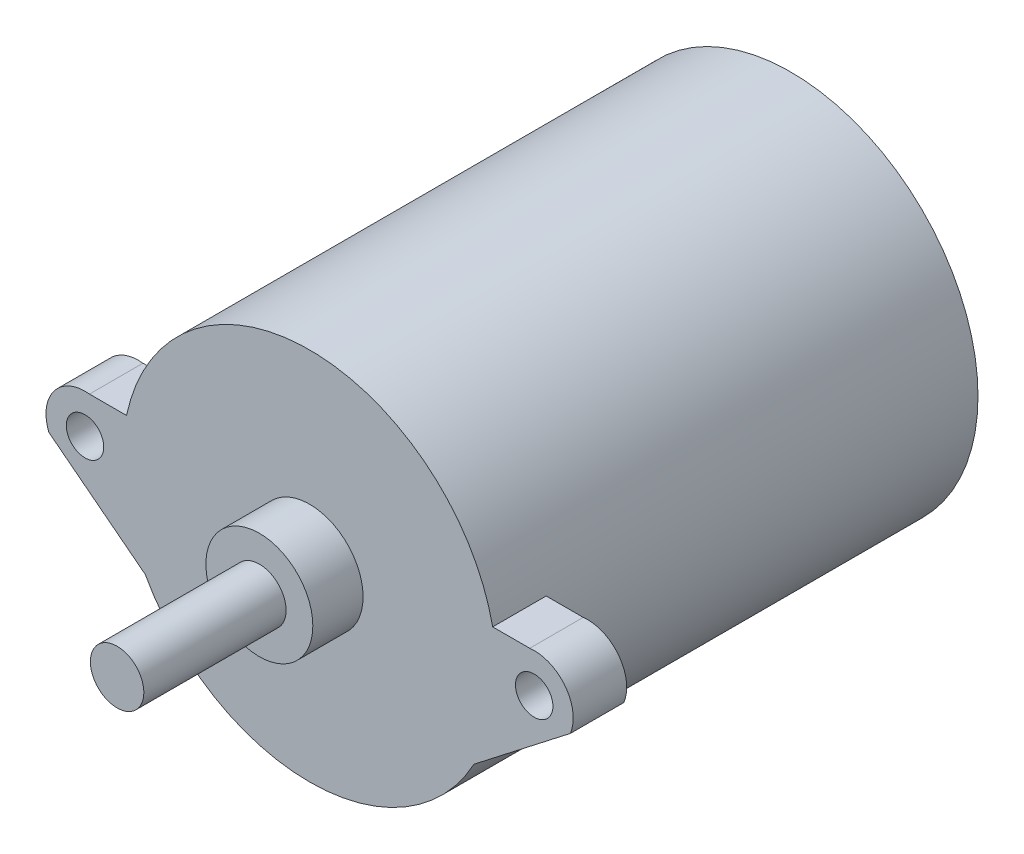
ISO-10303-21;
HEADER;
FILE_DESCRIPTION(('STEP AP214'),'2;1');
FILE_NAME('part.step','',(''),(''),'','','');
FILE_SCHEMA(('AUTOMOTIVE_DESIGN { 1 0 10303 214 1 1 1 1 }'));
ENDSEC;
DATA;
#1=APPLICATION_CONTEXT('core data for automotive mechanical design processes');
#2=APPLICATION_PROTOCOL_DEFINITION('international standard','automotive_design',2000,#1);
#3=PRODUCT_CONTEXT('',#1,'mechanical');
#4=PRODUCT('Part','Part','',(#3));
#5=PRODUCT_RELATED_PRODUCT_CATEGORY('part','',(#4));
#6=PRODUCT_DEFINITION_FORMATION('','',#4);
#7=PRODUCT_DEFINITION_CONTEXT('part definition',#1,'design');
#8=PRODUCT_DEFINITION('design','',#6,#7);
#9=PRODUCT_DEFINITION_SHAPE('','',#8);
#10=(LENGTH_UNIT() NAMED_UNIT(*) SI_UNIT(.MILLI.,.METRE.));
#11=(NAMED_UNIT(*) PLANE_ANGLE_UNIT() SI_UNIT($,.RADIAN.));
#12=(NAMED_UNIT(*) SI_UNIT($,.STERADIAN.) SOLID_ANGLE_UNIT());
#13=UNCERTAINTY_MEASURE_WITH_UNIT(LENGTH_MEASURE(1.E-05),#10,'distance_accuracy_value','');
#14=(GEOMETRIC_REPRESENTATION_CONTEXT(3) GLOBAL_UNCERTAINTY_ASSIGNED_CONTEXT((#13)) GLOBAL_UNIT_ASSIGNED_CONTEXT((#10,
#11,#12)) REPRESENTATION_CONTEXT('',''));
#15=CARTESIAN_POINT('',(0.,0.,0.));
#16=DIRECTION('',(0.,0.,1.));
#17=DIRECTION('',(1.,0.,0.));
#18=AXIS2_PLACEMENT_3D('',#15,#16,#17);
#19=CARTESIAN_POINT('',(0.,0.,-11.98));
#20=DIRECTION('',(0.,0.,1.));
#21=DIRECTION('',(1.,0.,0.));
#22=AXIS2_PLACEMENT_3D('',#19,#20,#21);
#23=CYLINDRICAL_SURFACE('',#22,17.5);
#24=DIRECTION('',(0.,0.,1.));
#25=VECTOR('',#24,1.);
#26=CARTESIAN_POINT('',(-15.3665085315704,-8.37379337870087,28.02));
#27=LINE('',#26,#25);
#28=CARTESIAN_POINT('',(-15.3665085315704,-8.37379337870087,28.02));
#29=VERTEX_POINT('',#28);
#30=CARTESIAN_POINT('',(-15.3665085315704,-8.37379337870086,33.02));
#31=VERTEX_POINT('',#30);
#32=EDGE_CURVE('E123',#29,#31,#27,.T.);
#33=ORIENTED_EDGE('',*,*,#32,.F.);
#34=CARTESIAN_POINT('',(0.,0.,28.02));
#35=DIRECTION('',(0.,0.,1.));
#36=DIRECTION('',(1.,0.,0.));
#37=AXIS2_PLACEMENT_3D('',#34,#35,#36);
#38=CIRCLE('',#37,17.5);
#39=CARTESIAN_POINT('',(-17.1201818197018,3.62620662129913,28.02));
#40=VERTEX_POINT('',#39);
#41=EDGE_CURVE('E11',#29,#40,#38,.F.);
#42=ORIENTED_EDGE('',*,*,#41,.T.);
#43=DIRECTION('',(0.,0.,1.));
#44=VECTOR('',#43,1.);
#45=CARTESIAN_POINT('',(-17.1201818197018,3.62620662129913,28.02));
#46=LINE('',#45,#44);
#47=CARTESIAN_POINT('',(-17.1201818197018,3.62620662129913,33.02));
#48=VERTEX_POINT('',#47);
#49=EDGE_CURVE('E100',#40,#48,#46,.T.);
#50=ORIENTED_EDGE('',*,*,#49,.T.);
#51=CARTESIAN_POINT('',(0.,0.,33.02));
#52=DIRECTION('',(0.,0.,1.));
#53=DIRECTION('',(1.,0.,0.));
#54=AXIS2_PLACEMENT_3D('',#51,#52,#53);
#55=CIRCLE('',#54,17.5);
#56=CARTESIAN_POINT('',(17.1201818197018,3.62620662129913,33.02));
#57=VERTEX_POINT('',#56);
#58=EDGE_CURVE('E176',#57,#48,#55,.T.);
#59=ORIENTED_EDGE('',*,*,#58,.F.);
#60=DIRECTION('',(0.,0.,1.));
#61=VECTOR('',#60,1.);
#62=CARTESIAN_POINT('',(17.1201818197018,3.62620662129913,28.02));
#63=LINE('',#62,#61);
#64=CARTESIAN_POINT('',(17.1201818197018,3.62620662129913,28.02));
#65=VERTEX_POINT('',#64);
#66=EDGE_CURVE('E156',#65,#57,#63,.T.);
#67=ORIENTED_EDGE('',*,*,#66,.F.);
#68=CARTESIAN_POINT('',(0.,0.,28.02));
#69=DIRECTION('',(0.,0.,-1.));
#70=DIRECTION('',(-1.,0.,0.));
#71=AXIS2_PLACEMENT_3D('',#68,#69,#70);
#72=CIRCLE('',#71,17.5);
#73=CARTESIAN_POINT('',(15.3665085315704,-8.37379337870087,28.02));
#74=VERTEX_POINT('',#73);
#75=EDGE_CURVE('E41',#74,#65,#72,.F.);
#76=ORIENTED_EDGE('',*,*,#75,.F.);
#77=DIRECTION('',(0.,0.,1.));
#78=VECTOR('',#77,1.);
#79=CARTESIAN_POINT('',(15.3665085315704,-8.37379337870087,28.02));
#80=LINE('',#79,#78);
#81=CARTESIAN_POINT('',(15.3665085315704,-8.37379337870087,33.02));
#82=VERTEX_POINT('',#81);
#83=EDGE_CURVE('E150',#74,#82,#80,.T.);
#84=ORIENTED_EDGE('',*,*,#83,.T.);
#85=EDGE_CURVE('E125',#31,#82,#55,.T.);
#86=ORIENTED_EDGE('',*,*,#85,.F.);
#87=EDGE_LOOP('',(#33,#42,#50,#59,#67,#76,#84,#86));
#88=FACE_BOUND('',#87,.T.);
#89=CARTESIAN_POINT('',(0.,0.,-11.98));
#90=DIRECTION('',(0.,0.,1.));
#91=DIRECTION('',(1.,0.,0.));
#92=AXIS2_PLACEMENT_3D('',#89,#90,#91);
#93=CIRCLE('',#92,17.5);
#94=CARTESIAN_POINT('',(17.5,0.,-11.98));
#95=VERTEX_POINT('',#94);
#96=EDGE_CURVE('E172',#95,#95,#93,.T.);
#97=ORIENTED_EDGE('',*,*,#96,.T.);
#98=EDGE_LOOP('',(#97));
#99=FACE_BOUND('',#98,.T.);
#100=ADVANCED_FACE('F34',(#88,#99),#23,.T.);
#101=CARTESIAN_POINT('',(0.,0.,-11.98));
#102=DIRECTION('',(0.,0.,1.));
#103=DIRECTION('',(1.,0.,0.));
#104=AXIS2_PLACEMENT_3D('',#101,#102,#103);
#105=PLANE('',#104);
#106=ORIENTED_EDGE('',*,*,#96,.F.);
#107=EDGE_LOOP('',(#106));
#108=FACE_BOUND('',#107,.T.);
#109=ADVANCED_FACE('F207',(#108),#105,.F.);
#110=CARTESIAN_POINT('',(0.,0.,33.02));
#111=DIRECTION('',(0.,0.,1.));
#112=DIRECTION('',(1.,0.,0.));
#113=AXIS2_PLACEMENT_3D('',#110,#111,#112);
#114=PLANE('',#113);
#115=ORIENTED_EDGE('',*,*,#58,.T.);
#116=DIRECTION('',(-1.,0.,0.));
#117=VECTOR('',#116,1.);
#118=CARTESIAN_POINT('',(-17.1201818197018,3.62620662129913,33.02));
#119=LINE('',#118,#117);
#120=CARTESIAN_POINT('',(-20.583916427089,3.62620662129913,33.02));
#121=VERTEX_POINT('',#120);
#122=EDGE_CURVE('E105',#48,#121,#119,.T.);
#123=ORIENTED_EDGE('',*,*,#122,.T.);
#124=CARTESIAN_POINT('',(-21.,0.,33.02));
#125=DIRECTION('',(0.,0.,1.));
#126=DIRECTION('',(1.,0.,0.));
#127=AXIS2_PLACEMENT_3D('',#124,#125,#126);
#128=CIRCLE('',#127,3.65);
#129=CARTESIAN_POINT('',(-24.3815960362878,-1.37379337870087,33.02));
#130=VERTEX_POINT('',#129);
#131=EDGE_CURVE('E191',#121,#130,#128,.T.);
#132=ORIENTED_EDGE('',*,*,#131,.T.);
#133=DIRECTION('',(0.789850204711775,-0.613299807693404,0.));
#134=VECTOR('',#133,1.);
#135=CARTESIAN_POINT('',(-15.3665085315704,-8.37379337870087,33.02));
#136=LINE('',#135,#134);
#137=EDGE_CURVE('E48',#130,#31,#136,.T.);
#138=ORIENTED_EDGE('',*,*,#137,.T.);
#139=ORIENTED_EDGE('',*,*,#85,.T.);
#140=DIRECTION('',(0.789850204711775,0.613299807693404,0.));
#141=VECTOR('',#140,1.);
#142=CARTESIAN_POINT('',(15.3665085315704,-8.37379337870087,33.02));
#143=LINE('',#142,#141);
#144=CARTESIAN_POINT('',(24.3815960362878,-1.37379337870087,33.02));
#145=VERTEX_POINT('',#144);
#146=EDGE_CURVE('E139',#82,#145,#143,.T.);
#147=ORIENTED_EDGE('',*,*,#146,.T.);
#148=CARTESIAN_POINT('',(21.,0.,33.02));
#149=DIRECTION('',(0.,0.,1.));
#150=DIRECTION('',(-1.,0.,0.));
#151=AXIS2_PLACEMENT_3D('',#148,#149,#150);
#152=CIRCLE('',#151,3.65);
#153=CARTESIAN_POINT('',(20.583916427089,3.62620662129913,33.02));
#154=VERTEX_POINT('',#153);
#155=EDGE_CURVE('E153',#145,#154,#152,.T.);
#156=ORIENTED_EDGE('',*,*,#155,.T.);
#157=DIRECTION('',(-1.,0.,0.));
#158=VECTOR('',#157,1.);
#159=CARTESIAN_POINT('',(17.1201818197018,3.62620662129913,33.02));
#160=LINE('',#159,#158);
#161=EDGE_CURVE('E55',#154,#57,#160,.T.);
#162=ORIENTED_EDGE('',*,*,#161,.T.);
#163=EDGE_LOOP('',(#115,#123,#132,#138,#139,#147,#156,#162));
#164=FACE_BOUND('',#163,.T.);
#165=CARTESIAN_POINT('',(0.,0.,33.02));
#166=DIRECTION('',(0.,0.,1.));
#167=DIRECTION('',(1.,0.,0.));
#168=AXIS2_PLACEMENT_3D('',#165,#166,#167);
#169=CIRCLE('',#168,5.);
#170=CARTESIAN_POINT('',(5.,0.,33.02));
#171=VERTEX_POINT('',#170);
#172=EDGE_CURVE('E175',#171,#171,#169,.T.);
#173=ORIENTED_EDGE('',*,*,#172,.F.);
#174=EDGE_LOOP('',(#173));
#175=FACE_BOUND('',#174,.T.);
#176=CARTESIAN_POINT('',(21.,0.,33.02));
#177=DIRECTION('',(0.,0.,1.));
#178=DIRECTION('',(1.,0.,0.));
#179=AXIS2_PLACEMENT_3D('',#176,#177,#178);
#180=CIRCLE('',#179,1.75);
#181=CARTESIAN_POINT('',(22.75,0.,33.02));
#182=VERTEX_POINT('',#181);
#183=EDGE_CURVE('E127',#182,#182,#180,.T.);
#184=ORIENTED_EDGE('',*,*,#183,.F.);
#185=EDGE_LOOP('',(#184));
#186=FACE_BOUND('',#185,.T.);
#187=CARTESIAN_POINT('',(-21.,0.,33.02));
#188=DIRECTION('',(0.,0.,1.));
#189=DIRECTION('',(1.,0.,0.));
#190=AXIS2_PLACEMENT_3D('',#187,#188,#189);
#191=CIRCLE('',#190,1.75);
#192=CARTESIAN_POINT('',(-19.25,0.,33.02));
#193=VERTEX_POINT('',#192);
#194=EDGE_CURVE('E195',#193,#193,#191,.T.);
#195=ORIENTED_EDGE('',*,*,#194,.F.);
#196=EDGE_LOOP('',(#195));
#197=FACE_BOUND('',#196,.T.);
#198=ADVANCED_FACE('F188',(#164,#175,#186,#197),#114,.T.);
#199=CARTESIAN_POINT('',(0.,0.,33.02));
#200=DIRECTION('',(0.,0.,1.));
#201=DIRECTION('',(1.,0.,0.));
#202=AXIS2_PLACEMENT_3D('',#199,#200,#201);
#203=CYLINDRICAL_SURFACE('',#202,5.);
#204=ORIENTED_EDGE('',*,*,#172,.T.);
#205=EDGE_LOOP('',(#204));
#206=FACE_BOUND('',#205,.T.);
#207=CARTESIAN_POINT('',(0.,0.,37.72));
#208=DIRECTION('',(0.,0.,1.));
#209=DIRECTION('',(1.,0.,0.));
#210=AXIS2_PLACEMENT_3D('',#207,#208,#209);
#211=CIRCLE('',#210,5.);
#212=CARTESIAN_POINT('',(5.,0.,37.72));
#213=VERTEX_POINT('',#212);
#214=EDGE_CURVE('E158',#213,#213,#211,.T.);
#215=ORIENTED_EDGE('',*,*,#214,.F.);
#216=EDGE_LOOP('',(#215));
#217=FACE_BOUND('',#216,.T.);
#218=ADVANCED_FACE('F206',(#206,#217),#203,.T.);
#219=CARTESIAN_POINT('',(0.,0.,51.02));
#220=DIRECTION('',(0.,0.,1.));
#221=DIRECTION('',(1.,0.,0.));
#222=AXIS2_PLACEMENT_3D('',#219,#220,#221);
#223=PLANE('',#222);
#224=CARTESIAN_POINT('',(0.,0.,51.02));
#225=DIRECTION('',(0.,0.,1.));
#226=DIRECTION('',(1.,0.,0.));
#227=AXIS2_PLACEMENT_3D('',#224,#225,#226);
#228=CIRCLE('',#227,2.5);
#229=CARTESIAN_POINT('',(2.5,0.,51.02));
#230=VERTEX_POINT('',#229);
#231=EDGE_CURVE('E169',#230,#230,#228,.T.);
#232=ORIENTED_EDGE('',*,*,#231,.T.);
#233=EDGE_LOOP('',(#232));
#234=FACE_BOUND('',#233,.T.);
#235=ADVANCED_FACE('F212',(#234),#223,.T.);
#236=CARTESIAN_POINT('',(0.,0.,33.02));
#237=DIRECTION('',(0.,0.,1.));
#238=DIRECTION('',(1.,0.,0.));
#239=AXIS2_PLACEMENT_3D('',#236,#237,#238);
#240=CYLINDRICAL_SURFACE('',#239,2.5);
#241=CARTESIAN_POINT('',(0.,0.,37.72));
#242=DIRECTION('',(0.,0.,1.));
#243=DIRECTION('',(1.,0.,0.));
#244=AXIS2_PLACEMENT_3D('',#241,#242,#243);
#245=CIRCLE('',#244,2.5);
#246=CARTESIAN_POINT('',(2.5,0.,37.72));
#247=VERTEX_POINT('',#246);
#248=EDGE_CURVE('E166',#247,#247,#245,.T.);
#249=ORIENTED_EDGE('',*,*,#248,.T.);
#250=EDGE_LOOP('',(#249));
#251=FACE_BOUND('',#250,.T.);
#252=ORIENTED_EDGE('',*,*,#231,.F.);
#253=EDGE_LOOP('',(#252));
#254=FACE_BOUND('',#253,.T.);
#255=ADVANCED_FACE('F241',(#251,#254),#240,.T.);
#256=CARTESIAN_POINT('',(2.5,0.,37.72));
#257=DIRECTION('',(0.,0.,1.));
#258=DIRECTION('',(1.,0.,0.));
#259=AXIS2_PLACEMENT_3D('',#256,#257,#258);
#260=PLANE('',#259);
#261=ORIENTED_EDGE('',*,*,#214,.T.);
#262=EDGE_LOOP('',(#261));
#263=FACE_BOUND('',#262,.T.);
#264=ORIENTED_EDGE('',*,*,#248,.F.);
#265=EDGE_LOOP('',(#264));
#266=FACE_BOUND('',#265,.T.);
#267=ADVANCED_FACE('F250',(#263,#266),#260,.T.);
#268=CARTESIAN_POINT('',(17.1201818197018,3.62620662129913,28.02));
#269=DIRECTION('',(0.,1.,0.));
#270=DIRECTION('',(-1.,0.,0.));
#271=AXIS2_PLACEMENT_3D('',#268,#269,#270);
#272=PLANE('',#271);
#273=ORIENTED_EDGE('',*,*,#161,.F.);
#274=DIRECTION('',(0.,0.,1.));
#275=VECTOR('',#274,1.);
#276=CARTESIAN_POINT('',(20.583916427089,3.62620662129913,28.02));
#277=LINE('',#276,#275);
#278=CARTESIAN_POINT('',(20.583916427089,3.62620662129913,28.02));
#279=VERTEX_POINT('',#278);
#280=EDGE_CURVE('E159',#279,#154,#277,.T.);
#281=ORIENTED_EDGE('',*,*,#280,.F.);
#282=DIRECTION('',(-1.,0.,0.));
#283=VECTOR('',#282,1.);
#284=CARTESIAN_POINT('',(17.1201818197018,3.62620662129913,28.02));
#285=LINE('',#284,#283);
#286=EDGE_CURVE('E147',#279,#65,#285,.T.);
#287=ORIENTED_EDGE('',*,*,#286,.T.);
#288=ORIENTED_EDGE('',*,*,#66,.T.);
#289=EDGE_LOOP('',(#273,#281,#287,#288));
#290=FACE_BOUND('',#289,.T.);
#291=ADVANCED_FACE('F187',(#290),#272,.T.);
#292=CARTESIAN_POINT('',(21.,0.,28.02));
#293=DIRECTION('',(0.,0.,1.));
#294=DIRECTION('',(1.,0.,0.));
#295=AXIS2_PLACEMENT_3D('',#292,#293,#294);
#296=CYLINDRICAL_SURFACE('',#295,3.65);
#297=ORIENTED_EDGE('',*,*,#155,.F.);
#298=DIRECTION('',(0.,0.,1.));
#299=VECTOR('',#298,1.);
#300=CARTESIAN_POINT('',(24.3815960362878,-1.37379337870087,28.02));
#301=LINE('',#300,#299);
#302=CARTESIAN_POINT('',(24.3815960362878,-1.37379337870087,28.02));
#303=VERTEX_POINT('',#302);
#304=EDGE_CURVE('E161',#303,#145,#301,.T.);
#305=ORIENTED_EDGE('',*,*,#304,.F.);
#306=CARTESIAN_POINT('',(21.,0.,28.02));
#307=DIRECTION('',(0.,0.,1.));
#308=DIRECTION('',(-1.,0.,0.));
#309=AXIS2_PLACEMENT_3D('',#306,#307,#308);
#310=CIRCLE('',#309,3.65);
#311=EDGE_CURVE('E144',#303,#279,#310,.T.);
#312=ORIENTED_EDGE('',*,*,#311,.T.);
#313=ORIENTED_EDGE('',*,*,#280,.T.);
#314=EDGE_LOOP('',(#297,#305,#312,#313));
#315=FACE_BOUND('',#314,.T.);
#316=ADVANCED_FACE('F271',(#315),#296,.T.);
#317=CARTESIAN_POINT('',(15.3665085315704,-8.37379337870087,28.02));
#318=DIRECTION('',(0.613299807693404,-0.789850204711775,0.));
#319=DIRECTION('',(0.789850204711775,0.613299807693404,0.));
#320=AXIS2_PLACEMENT_3D('',#317,#318,#319);
#321=PLANE('',#320);
#322=ORIENTED_EDGE('',*,*,#146,.F.);
#323=ORIENTED_EDGE('',*,*,#83,.F.);
#324=DIRECTION('',(0.789850204711775,0.613299807693404,0.));
#325=VECTOR('',#324,1.);
#326=CARTESIAN_POINT('',(15.3665085315704,-8.37379337870087,28.02));
#327=LINE('',#326,#325);
#328=EDGE_CURVE('E141',#74,#303,#327,.T.);
#329=ORIENTED_EDGE('',*,*,#328,.T.);
#330=ORIENTED_EDGE('',*,*,#304,.T.);
#331=EDGE_LOOP('',(#322,#323,#329,#330));
#332=FACE_BOUND('',#331,.T.);
#333=ADVANCED_FACE('F278',(#332),#321,.T.);
#334=CARTESIAN_POINT('',(21.,0.,28.02));
#335=DIRECTION('',(0.,0.,-1.));
#336=DIRECTION('',(-1.,0.,0.));
#337=AXIS2_PLACEMENT_3D('',#334,#335,#336);
#338=PLANE('',#337);
#339=CARTESIAN_POINT('',(21.,0.,28.02));
#340=DIRECTION('',(0.,0.,1.));
#341=DIRECTION('',(1.,0.,0.));
#342=AXIS2_PLACEMENT_3D('',#339,#340,#341);
#343=CIRCLE('',#342,1.75);
#344=CARTESIAN_POINT('',(22.75,0.,28.02));
#345=VERTEX_POINT('',#344);
#346=EDGE_CURVE('E131',#345,#345,#343,.T.);
#347=ORIENTED_EDGE('',*,*,#346,.T.);
#348=EDGE_LOOP('',(#347));
#349=FACE_BOUND('',#348,.T.);
#350=ORIENTED_EDGE('',*,*,#328,.F.);
#351=ORIENTED_EDGE('',*,*,#75,.T.);
#352=ORIENTED_EDGE('',*,*,#286,.F.);
#353=ORIENTED_EDGE('',*,*,#311,.F.);
#354=EDGE_LOOP('',(#350,#351,#352,#353));
#355=FACE_BOUND('',#354,.T.);
#356=ADVANCED_FACE('F183',(#349,#355),#338,.T.);
#357=CARTESIAN_POINT('',(21.,0.,28.02));
#358=DIRECTION('',(0.,0.,1.));
#359=DIRECTION('',(1.,0.,0.));
#360=AXIS2_PLACEMENT_3D('',#357,#358,#359);
#361=CYLINDRICAL_SURFACE('',#360,1.75);
#362=ORIENTED_EDGE('',*,*,#346,.F.);
#363=EDGE_LOOP('',(#362));
#364=FACE_BOUND('',#363,.T.);
#365=ORIENTED_EDGE('',*,*,#183,.T.);
#366=EDGE_LOOP('',(#365));
#367=FACE_BOUND('',#366,.T.);
#368=ADVANCED_FACE('F293',(#364,#367),#361,.F.);
#369=CARTESIAN_POINT('',(-15.3665085315704,-8.37379337870087,28.02));
#370=DIRECTION('',(-0.613299807693404,-0.789850204711775,0.));
#371=DIRECTION('',(0.789850204711775,-0.613299807693404,0.));
#372=AXIS2_PLACEMENT_3D('',#369,#370,#371);
#373=PLANE('',#372);
#374=ORIENTED_EDGE('',*,*,#137,.F.);
#375=DIRECTION('',(0.,0.,1.));
#376=VECTOR('',#375,1.);
#377=CARTESIAN_POINT('',(-24.3815960362878,-1.37379337870087,28.02));
#378=LINE('',#377,#376);
#379=CARTESIAN_POINT('',(-24.3815960362878,-1.37379337870087,28.02));
#380=VERTEX_POINT('',#379);
#381=EDGE_CURVE('E128',#380,#130,#378,.T.);
#382=ORIENTED_EDGE('',*,*,#381,.F.);
#383=DIRECTION('',(0.789850204711775,-0.613299807693404,0.));
#384=VECTOR('',#383,1.);
#385=CARTESIAN_POINT('',(-15.3665085315704,-8.37379337870087,28.02));
#386=LINE('',#385,#384);
#387=EDGE_CURVE('E109',#380,#29,#386,.T.);
#388=ORIENTED_EDGE('',*,*,#387,.T.);
#389=ORIENTED_EDGE('',*,*,#32,.T.);
#390=EDGE_LOOP('',(#374,#382,#388,#389));
#391=FACE_BOUND('',#390,.T.);
#392=ADVANCED_FACE('F301',(#391),#373,.T.);
#393=CARTESIAN_POINT('',(-21.,0.,28.02));
#394=DIRECTION('',(0.,0.,1.));
#395=DIRECTION('',(1.,0.,0.));
#396=AXIS2_PLACEMENT_3D('',#393,#394,#395);
#397=CYLINDRICAL_SURFACE('',#396,3.65);
#398=ORIENTED_EDGE('',*,*,#131,.F.);
#399=DIRECTION('',(0.,0.,1.));
#400=VECTOR('',#399,1.);
#401=CARTESIAN_POINT('',(-20.583916427089,3.62620662129913,28.02));
#402=LINE('',#401,#400);
#403=CARTESIAN_POINT('',(-20.583916427089,3.62620662129913,28.02));
#404=VERTEX_POINT('',#403);
#405=EDGE_CURVE('E108',#404,#121,#402,.T.);
#406=ORIENTED_EDGE('',*,*,#405,.F.);
#407=CARTESIAN_POINT('',(-21.,0.,28.02));
#408=DIRECTION('',(0.,0.,1.));
#409=DIRECTION('',(1.,0.,0.));
#410=AXIS2_PLACEMENT_3D('',#407,#408,#409);
#411=CIRCLE('',#410,3.65);
#412=EDGE_CURVE('E118',#404,#380,#411,.T.);
#413=ORIENTED_EDGE('',*,*,#412,.T.);
#414=ORIENTED_EDGE('',*,*,#381,.T.);
#415=EDGE_LOOP('',(#398,#406,#413,#414));
#416=FACE_BOUND('',#415,.T.);
#417=ADVANCED_FACE('F309',(#416),#397,.T.);
#418=CARTESIAN_POINT('',(-17.1201818197018,3.62620662129913,28.02));
#419=DIRECTION('',(0.,1.,0.));
#420=DIRECTION('',(-1.,0.,0.));
#421=AXIS2_PLACEMENT_3D('',#418,#419,#420);
#422=PLANE('',#421);
#423=ORIENTED_EDGE('',*,*,#122,.F.);
#424=ORIENTED_EDGE('',*,*,#49,.F.);
#425=DIRECTION('',(-1.,0.,0.));
#426=VECTOR('',#425,1.);
#427=CARTESIAN_POINT('',(-17.1201818197018,3.62620662129913,28.02));
#428=LINE('',#427,#426);
#429=EDGE_CURVE('E103',#40,#404,#428,.T.);
#430=ORIENTED_EDGE('',*,*,#429,.T.);
#431=ORIENTED_EDGE('',*,*,#405,.T.);
#432=EDGE_LOOP('',(#423,#424,#430,#431));
#433=FACE_BOUND('',#432,.T.);
#434=ADVANCED_FACE('F102',(#433),#422,.T.);
#435=CARTESIAN_POINT('',(-21.,0.,28.02));
#436=DIRECTION('',(0.,0.,1.));
#437=DIRECTION('',(1.,0.,0.));
#438=AXIS2_PLACEMENT_3D('',#435,#436,#437);
#439=PLANE('',#438);
#440=ORIENTED_EDGE('',*,*,#41,.F.);
#441=ORIENTED_EDGE('',*,*,#387,.F.);
#442=ORIENTED_EDGE('',*,*,#412,.F.);
#443=ORIENTED_EDGE('',*,*,#429,.F.);
#444=EDGE_LOOP('',(#440,#441,#442,#443));
#445=FACE_BOUND('',#444,.T.);
#446=CARTESIAN_POINT('',(-21.,0.,28.02));
#447=DIRECTION('',(0.,0.,1.));
#448=DIRECTION('',(1.,0.,0.));
#449=AXIS2_PLACEMENT_3D('',#446,#447,#448);
#450=CIRCLE('',#449,1.75);
#451=CARTESIAN_POINT('',(-19.25,0.,28.02));
#452=VERTEX_POINT('',#451);
#453=EDGE_CURVE('E192',#452,#452,#450,.T.);
#454=ORIENTED_EDGE('',*,*,#453,.T.);
#455=EDGE_LOOP('',(#454));
#456=FACE_BOUND('',#455,.T.);
#457=ADVANCED_FACE('F113',(#445,#456),#439,.F.);
#458=CARTESIAN_POINT('',(-21.,0.,28.02));
#459=DIRECTION('',(0.,0.,1.));
#460=DIRECTION('',(1.,0.,0.));
#461=AXIS2_PLACEMENT_3D('',#458,#459,#460);
#462=CYLINDRICAL_SURFACE('',#461,1.75);
#463=ORIENTED_EDGE('',*,*,#453,.F.);
#464=EDGE_LOOP('',(#463));
#465=FACE_BOUND('',#464,.T.);
#466=ORIENTED_EDGE('',*,*,#194,.T.);
#467=EDGE_LOOP('',(#466));
#468=FACE_BOUND('',#467,.T.);
#469=ADVANCED_FACE('F203',(#465,#468),#462,.F.);
#470=CLOSED_SHELL('',(#100,#109,#198,#218,#235,#255,#267,#291,#316,#333,#356,#368,#392,#417,
#434,#457,#469));
#471=MANIFOLD_SOLID_BREP('B2',#470);
#472=ADVANCED_BREP_SHAPE_REPRESENTATION('',(#18,#471),#14);
#473=SHAPE_DEFINITION_REPRESENTATION(#9,#472);
ENDSEC;
END-ISO-10303-21;
